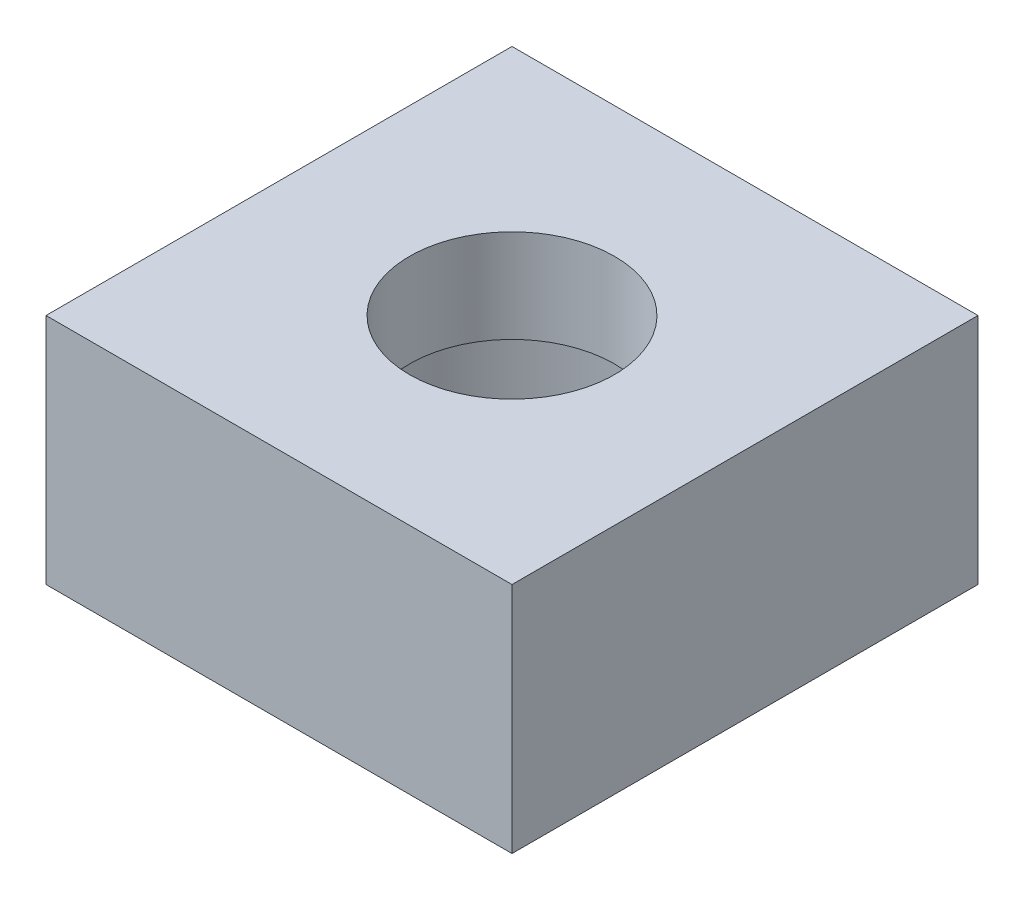
ISO-10303-21;
HEADER;
FILE_DESCRIPTION(('STEP AP214'),'2;1');
FILE_NAME('part.step','',(''),(''),'','','');
FILE_SCHEMA(('AUTOMOTIVE_DESIGN { 1 0 10303 214 1 1 1 1 }'));
ENDSEC;
DATA;
#1=APPLICATION_CONTEXT('core data for automotive mechanical design processes');
#2=APPLICATION_PROTOCOL_DEFINITION('international standard','automotive_design',2000,#1);
#3=PRODUCT_CONTEXT('',#1,'mechanical');
#4=PRODUCT('Part','Part','',(#3));
#5=PRODUCT_RELATED_PRODUCT_CATEGORY('part','',(#4));
#6=PRODUCT_DEFINITION_FORMATION('','',#4);
#7=PRODUCT_DEFINITION_CONTEXT('part definition',#1,'design');
#8=PRODUCT_DEFINITION('design','',#6,#7);
#9=PRODUCT_DEFINITION_SHAPE('','',#8);
#10=(LENGTH_UNIT() NAMED_UNIT(*) SI_UNIT(.MILLI.,.METRE.));
#11=(NAMED_UNIT(*) PLANE_ANGLE_UNIT() SI_UNIT($,.RADIAN.));
#12=(NAMED_UNIT(*) SI_UNIT($,.STERADIAN.) SOLID_ANGLE_UNIT());
#13=UNCERTAINTY_MEASURE_WITH_UNIT(LENGTH_MEASURE(1.E-05),#10,'distance_accuracy_value','');
#14=(GEOMETRIC_REPRESENTATION_CONTEXT(3) GLOBAL_UNCERTAINTY_ASSIGNED_CONTEXT((#13)) GLOBAL_UNIT_ASSIGNED_CONTEXT((#10,
#11,#12)) REPRESENTATION_CONTEXT('',''));
#15=CARTESIAN_POINT('',(0.,0.,0.));
#16=DIRECTION('',(0.,0.,1.));
#17=DIRECTION('',(1.,0.,0.));
#18=AXIS2_PLACEMENT_3D('',#15,#16,#17);
#19=CARTESIAN_POINT('',(0.,5.,0.));
#20=DIRECTION('',(0.,-1.,0.));
#21=DIRECTION('',(0.,0.,-1.));
#22=AXIS2_PLACEMENT_3D('',#19,#20,#21);
#23=CYLINDRICAL_SURFACE('',#22,2.2);
#24=CARTESIAN_POINT('',(0.,5.,0.));
#25=DIRECTION('',(0.,1.,0.));
#26=DIRECTION('',(0.,0.,1.));
#27=AXIS2_PLACEMENT_3D('',#24,#25,#26);
#28=CIRCLE('',#27,2.2);
#29=CARTESIAN_POINT('',(0.,5.,2.2));
#30=VERTEX_POINT('',#29);
#31=EDGE_CURVE('E106',#30,#30,#28,.T.);
#32=ORIENTED_EDGE('',*,*,#31,.T.);
#33=EDGE_LOOP('',(#32));
#34=FACE_BOUND('',#33,.T.);
#35=CARTESIAN_POINT('',(0.,3.,0.));
#36=DIRECTION('',(0.,-1.,0.));
#37=DIRECTION('',(0.,0.,-1.));
#38=AXIS2_PLACEMENT_3D('',#35,#36,#37);
#39=CIRCLE('',#38,2.2);
#40=CARTESIAN_POINT('',(0.,3.,-2.2));
#41=VERTEX_POINT('',#40);
#42=EDGE_CURVE('E160',#41,#41,#39,.F.);
#43=ORIENTED_EDGE('',*,*,#42,.F.);
#44=EDGE_LOOP('',(#43));
#45=FACE_BOUND('',#44,.T.);
#46=ADVANCED_FACE('F39',(#34,#45),#23,.F.);
#47=CARTESIAN_POINT('',(5.,5.,0.));
#48=DIRECTION('',(1.,0.,0.));
#49=DIRECTION('',(0.,0.,-1.));
#50=AXIS2_PLACEMENT_3D('',#47,#48,#49);
#51=PLANE('',#50);
#52=DIRECTION('',(0.,0.,1.));
#53=VECTOR('',#52,1.);
#54=CARTESIAN_POINT('',(5.,0.,0.));
#55=LINE('',#54,#53);
#56=CARTESIAN_POINT('',(5.,0.,-5.));
#57=VERTEX_POINT('',#56);
#58=CARTESIAN_POINT('',(5.,0.,5.));
#59=VERTEX_POINT('',#58);
#60=EDGE_CURVE('E112',#57,#59,#55,.T.);
#61=ORIENTED_EDGE('',*,*,#60,.F.);
#62=DIRECTION('',(0.,-1.,0.));
#63=VECTOR('',#62,1.);
#64=CARTESIAN_POINT('',(5.,5.,-5.));
#65=LINE('',#64,#63);
#66=CARTESIAN_POINT('',(5.,5.,-5.));
#67=VERTEX_POINT('',#66);
#68=EDGE_CURVE('E11',#67,#57,#65,.T.);
#69=ORIENTED_EDGE('',*,*,#68,.F.);
#70=DIRECTION('',(0.,0.,1.));
#71=VECTOR('',#70,1.);
#72=CARTESIAN_POINT('',(5.,5.,0.));
#73=LINE('',#72,#71);
#74=CARTESIAN_POINT('',(5.,5.,5.));
#75=VERTEX_POINT('',#74);
#76=EDGE_CURVE('E102',#67,#75,#73,.T.);
#77=ORIENTED_EDGE('',*,*,#76,.T.);
#78=DIRECTION('',(0.,-1.,0.));
#79=VECTOR('',#78,1.);
#80=CARTESIAN_POINT('',(5.,5.,5.));
#81=LINE('',#80,#79);
#82=EDGE_CURVE('E79',#75,#59,#81,.T.);
#83=ORIENTED_EDGE('',*,*,#82,.T.);
#84=EDGE_LOOP('',(#61,#69,#77,#83));
#85=FACE_BOUND('',#84,.T.);
#86=ADVANCED_FACE('F129',(#85),#51,.T.);
#87=CARTESIAN_POINT('',(0.,5.,-5.));
#88=DIRECTION('',(0.,0.,-1.));
#89=DIRECTION('',(-1.,0.,0.));
#90=AXIS2_PLACEMENT_3D('',#87,#88,#89);
#91=PLANE('',#90);
#92=DIRECTION('',(1.,0.,0.));
#93=VECTOR('',#92,1.);
#94=CARTESIAN_POINT('',(0.,0.,-5.));
#95=LINE('',#94,#93);
#96=CARTESIAN_POINT('',(-5.,0.,-5.));
#97=VERTEX_POINT('',#96);
#98=EDGE_CURVE('E91',#97,#57,#95,.T.);
#99=ORIENTED_EDGE('',*,*,#98,.F.);
#100=DIRECTION('',(0.,-1.,0.));
#101=VECTOR('',#100,1.);
#102=CARTESIAN_POINT('',(-5.,5.,-5.));
#103=LINE('',#102,#101);
#104=CARTESIAN_POINT('',(-5.,5.,-5.));
#105=VERTEX_POINT('',#104);
#106=EDGE_CURVE('E48',#105,#97,#103,.T.);
#107=ORIENTED_EDGE('',*,*,#106,.F.);
#108=DIRECTION('',(1.,0.,0.));
#109=VECTOR('',#108,1.);
#110=CARTESIAN_POINT('',(0.,5.,-5.));
#111=LINE('',#110,#109);
#112=EDGE_CURVE('E89',#105,#67,#111,.T.);
#113=ORIENTED_EDGE('',*,*,#112,.T.);
#114=ORIENTED_EDGE('',*,*,#68,.T.);
#115=EDGE_LOOP('',(#99,#107,#113,#114));
#116=FACE_BOUND('',#115,.T.);
#117=ADVANCED_FACE('F87',(#116),#91,.T.);
#118=CARTESIAN_POINT('',(-5.,5.,0.));
#119=DIRECTION('',(1.,0.,0.));
#120=DIRECTION('',(0.,0.,-1.));
#121=AXIS2_PLACEMENT_3D('',#118,#119,#120);
#122=PLANE('',#121);
#123=DIRECTION('',(0.,0.,1.));
#124=VECTOR('',#123,1.);
#125=CARTESIAN_POINT('',(-5.,0.,0.));
#126=LINE('',#125,#124);
#127=CARTESIAN_POINT('',(-5.,0.,5.));
#128=VERTEX_POINT('',#127);
#129=EDGE_CURVE('E118',#97,#128,#126,.T.);
#130=ORIENTED_EDGE('',*,*,#129,.T.);
#131=DIRECTION('',(0.,-1.,0.));
#132=VECTOR('',#131,1.);
#133=CARTESIAN_POINT('',(-5.,5.,5.));
#134=LINE('',#133,#132);
#135=CARTESIAN_POINT('',(-5.,5.,5.));
#136=VERTEX_POINT('',#135);
#137=EDGE_CURVE('E95',#136,#128,#134,.T.);
#138=ORIENTED_EDGE('',*,*,#137,.F.);
#139=DIRECTION('',(0.,0.,1.));
#140=VECTOR('',#139,1.);
#141=CARTESIAN_POINT('',(-5.,5.,0.));
#142=LINE('',#141,#140);
#143=EDGE_CURVE('E97',#105,#136,#142,.T.);
#144=ORIENTED_EDGE('',*,*,#143,.F.);
#145=ORIENTED_EDGE('',*,*,#106,.T.);
#146=EDGE_LOOP('',(#130,#138,#144,#145));
#147=FACE_BOUND('',#146,.T.);
#148=ADVANCED_FACE('F98',(#147),#122,.F.);
#149=CARTESIAN_POINT('',(0.,5.,5.));
#150=DIRECTION('',(0.,0.,-1.));
#151=DIRECTION('',(-1.,0.,0.));
#152=AXIS2_PLACEMENT_3D('',#149,#150,#151);
#153=PLANE('',#152);
#154=DIRECTION('',(1.,0.,0.));
#155=VECTOR('',#154,1.);
#156=CARTESIAN_POINT('',(0.,0.,5.));
#157=LINE('',#156,#155);
#158=EDGE_CURVE('E72',#128,#59,#157,.T.);
#159=ORIENTED_EDGE('',*,*,#158,.T.);
#160=ORIENTED_EDGE('',*,*,#82,.F.);
#161=DIRECTION('',(1.,0.,0.));
#162=VECTOR('',#161,1.);
#163=CARTESIAN_POINT('',(0.,5.,5.));
#164=LINE('',#163,#162);
#165=EDGE_CURVE('E56',#136,#75,#164,.T.);
#166=ORIENTED_EDGE('',*,*,#165,.F.);
#167=ORIENTED_EDGE('',*,*,#137,.T.);
#168=EDGE_LOOP('',(#159,#160,#166,#167));
#169=FACE_BOUND('',#168,.T.);
#170=ADVANCED_FACE('F127',(#169),#153,.F.);
#171=CARTESIAN_POINT('',(0.,5.,0.));
#172=DIRECTION('',(0.,1.,0.));
#173=DIRECTION('',(0.,0.,1.));
#174=AXIS2_PLACEMENT_3D('',#171,#172,#173);
#175=PLANE('',#174);
#176=ORIENTED_EDGE('',*,*,#31,.F.);
#177=EDGE_LOOP('',(#176));
#178=FACE_BOUND('',#177,.T.);
#179=ORIENTED_EDGE('',*,*,#76,.F.);
#180=ORIENTED_EDGE('',*,*,#112,.F.);
#181=ORIENTED_EDGE('',*,*,#143,.T.);
#182=ORIENTED_EDGE('',*,*,#165,.T.);
#183=EDGE_LOOP('',(#179,#180,#181,#182));
#184=FACE_BOUND('',#183,.T.);
#185=ADVANCED_FACE('F101',(#178,#184),#175,.T.);
#186=CARTESIAN_POINT('',(0.,0.,0.));
#187=DIRECTION('',(0.,1.,0.));
#188=DIRECTION('',(0.,0.,1.));
#189=AXIS2_PLACEMENT_3D('',#186,#187,#188);
#190=PLANE('',#189);
#191=CARTESIAN_POINT('',(0.,0.,0.));
#192=DIRECTION('',(0.,-1.,0.));
#193=DIRECTION('',(0.,0.,-1.));
#194=AXIS2_PLACEMENT_3D('',#191,#192,#193);
#195=CIRCLE('',#194,4.);
#196=CARTESIAN_POINT('',(0.,0.,-4.));
#197=VERTEX_POINT('',#196);
#198=EDGE_CURVE('E166',#197,#197,#195,.T.);
#199=ORIENTED_EDGE('',*,*,#198,.F.);
#200=EDGE_LOOP('',(#199));
#201=FACE_BOUND('',#200,.T.);
#202=ORIENTED_EDGE('',*,*,#60,.T.);
#203=ORIENTED_EDGE('',*,*,#158,.F.);
#204=ORIENTED_EDGE('',*,*,#129,.F.);
#205=ORIENTED_EDGE('',*,*,#98,.T.);
#206=EDGE_LOOP('',(#202,#203,#204,#205));
#207=FACE_BOUND('',#206,.T.);
#208=ADVANCED_FACE('F128',(#201,#207),#190,.F.);
#209=CARTESIAN_POINT('',(0.,3.,0.));
#210=DIRECTION('',(0.,-1.,0.));
#211=DIRECTION('',(0.,0.,-1.));
#212=AXIS2_PLACEMENT_3D('',#209,#210,#211);
#213=CYLINDRICAL_SURFACE('',#212,4.);
#214=CARTESIAN_POINT('',(0.,3.,0.));
#215=DIRECTION('',(0.,-1.,0.));
#216=DIRECTION('',(0.,0.,-1.));
#217=AXIS2_PLACEMENT_3D('',#214,#215,#216);
#218=CIRCLE('',#217,4.);
#219=CARTESIAN_POINT('',(0.,3.,-4.));
#220=VERTEX_POINT('',#219);
#221=EDGE_CURVE('E115',#220,#220,#218,.T.);
#222=ORIENTED_EDGE('',*,*,#221,.F.);
#223=EDGE_LOOP('',(#222));
#224=FACE_BOUND('',#223,.T.);
#225=ORIENTED_EDGE('',*,*,#198,.T.);
#226=EDGE_LOOP('',(#225));
#227=FACE_BOUND('',#226,.T.);
#228=ADVANCED_FACE('F144',(#224,#227),#213,.F.);
#229=CARTESIAN_POINT('',(0.,3.,0.));
#230=DIRECTION('',(0.,-1.,0.));
#231=DIRECTION('',(0.,0.,-1.));
#232=AXIS2_PLACEMENT_3D('',#229,#230,#231);
#233=PLANE('',#232);
#234=ORIENTED_EDGE('',*,*,#42,.T.);
#235=EDGE_LOOP('',(#234));
#236=FACE_BOUND('',#235,.T.);
#237=ORIENTED_EDGE('',*,*,#221,.T.);
#238=EDGE_LOOP('',(#237));
#239=FACE_BOUND('',#238,.T.);
#240=ADVANCED_FACE('F151',(#236,#239),#233,.T.);
#241=CLOSED_SHELL('',(#46,#86,#117,#148,#170,#185,#208,#228,#240));
#242=MANIFOLD_SOLID_BREP('B2',#241);
#243=ADVANCED_BREP_SHAPE_REPRESENTATION('',(#18,#242),#14);
#244=SHAPE_DEFINITION_REPRESENTATION(#9,#243);
ENDSEC;
END-ISO-10303-21;
